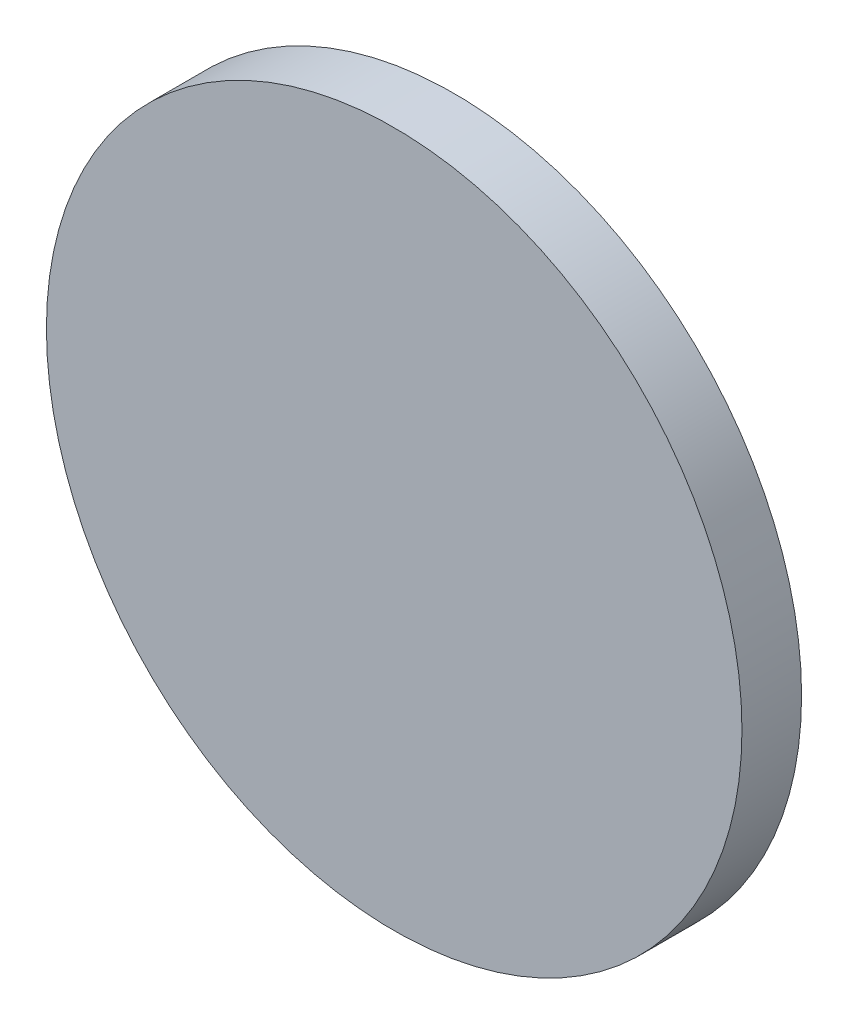
ISO-10303-21;
HEADER;
FILE_DESCRIPTION(('STEP AP214'),'2;1');
FILE_NAME('part.step','',(''),(''),'','','');
FILE_SCHEMA(('AUTOMOTIVE_DESIGN { 1 0 10303 214 1 1 1 1 }'));
ENDSEC;
DATA;
#1=APPLICATION_CONTEXT('core data for automotive mechanical design processes');
#2=APPLICATION_PROTOCOL_DEFINITION('international standard','automotive_design',2000,#1);
#3=PRODUCT_CONTEXT('',#1,'mechanical');
#4=PRODUCT('Part','Part','',(#3));
#5=PRODUCT_RELATED_PRODUCT_CATEGORY('part','',(#4));
#6=PRODUCT_DEFINITION_FORMATION('','',#4);
#7=PRODUCT_DEFINITION_CONTEXT('part definition',#1,'design');
#8=PRODUCT_DEFINITION('design','',#6,#7);
#9=PRODUCT_DEFINITION_SHAPE('','',#8);
#10=(LENGTH_UNIT() NAMED_UNIT(*) SI_UNIT(.MILLI.,.METRE.));
#11=(NAMED_UNIT(*) PLANE_ANGLE_UNIT() SI_UNIT($,.RADIAN.));
#12=(NAMED_UNIT(*) SI_UNIT($,.STERADIAN.) SOLID_ANGLE_UNIT());
#13=UNCERTAINTY_MEASURE_WITH_UNIT(LENGTH_MEASURE(1.E-05),#10,'distance_accuracy_value','');
#14=(GEOMETRIC_REPRESENTATION_CONTEXT(3) GLOBAL_UNCERTAINTY_ASSIGNED_CONTEXT((#13)) GLOBAL_UNIT_ASSIGNED_CONTEXT((#10,
#11,#12)) REPRESENTATION_CONTEXT('',''));
#15=CARTESIAN_POINT('',(0.,0.,0.));
#16=DIRECTION('',(0.,0.,1.));
#17=DIRECTION('',(1.,0.,0.));
#18=AXIS2_PLACEMENT_3D('',#15,#16,#17);
#19=CARTESIAN_POINT('',(7.5692,1.59004,0.));
#20=DIRECTION('',(0.,0.,-1.));
#21=DIRECTION('',(-1.,0.,0.));
#22=AXIS2_PLACEMENT_3D('',#19,#20,#21);
#23=PLANE('',#22);
#24=CARTESIAN_POINT('',(7.5692,1.59004,0.));
#25=DIRECTION('',(0.,0.,1.));
#26=DIRECTION('',(1.,0.,0.));
#27=AXIS2_PLACEMENT_3D('',#24,#25,#26);
#28=CIRCLE('',#27,0.200024667);
#29=CARTESIAN_POINT('',(7.769224667,1.59004,0.));
#30=VERTEX_POINT('',#29);
#31=EDGE_CURVE('E18',#30,#30,#28,.T.);
#32=ORIENTED_EDGE('',*,*,#31,.F.);
#33=EDGE_LOOP('',(#32));
#34=FACE_BOUND('',#33,.T.);
#35=ADVANCED_FACE('F15',(#34),#23,.T.);
#36=CARTESIAN_POINT('',(7.5692,1.59004,0.));
#37=DIRECTION('',(0.,0.,1.));
#38=DIRECTION('',(1.,0.,0.));
#39=AXIS2_PLACEMENT_3D('',#36,#37,#38);
#40=CYLINDRICAL_SURFACE('',#39,0.200024667);
#41=CARTESIAN_POINT('',(7.5692,1.59004,0.03429));
#42=DIRECTION('',(0.,0.,1.));
#43=DIRECTION('',(1.,0.,0.));
#44=AXIS2_PLACEMENT_3D('',#41,#42,#43);
#45=CIRCLE('',#44,0.200024667);
#46=CARTESIAN_POINT('',(7.769224667,1.59004,0.03429));
#47=VERTEX_POINT('',#46);
#48=EDGE_CURVE('E10',#47,#47,#45,.T.);
#49=ORIENTED_EDGE('',*,*,#48,.F.);
#50=EDGE_LOOP('',(#49));
#51=FACE_BOUND('',#50,.T.);
#52=ORIENTED_EDGE('',*,*,#31,.T.);
#53=EDGE_LOOP('',(#52));
#54=FACE_BOUND('',#53,.T.);
#55=ADVANCED_FACE('F27',(#51,#54),#40,.T.);
#56=CARTESIAN_POINT('',(7.5692,1.59004,0.03429));
#57=DIRECTION('',(0.,0.,1.));
#58=DIRECTION('',(1.,0.,0.));
#59=AXIS2_PLACEMENT_3D('',#56,#57,#58);
#60=PLANE('',#59);
#61=ORIENTED_EDGE('',*,*,#48,.T.);
#62=EDGE_LOOP('',(#61));
#63=FACE_BOUND('',#62,.T.);
#64=ADVANCED_FACE('F34',(#63),#60,.T.);
#65=CLOSED_SHELL('',(#35,#55,#64));
#66=MANIFOLD_SOLID_BREP('B1',#65);
#67=ADVANCED_BREP_SHAPE_REPRESENTATION('',(#18,#66),#14);
#68=SHAPE_DEFINITION_REPRESENTATION(#9,#67);
ENDSEC;
END-ISO-10303-21;
